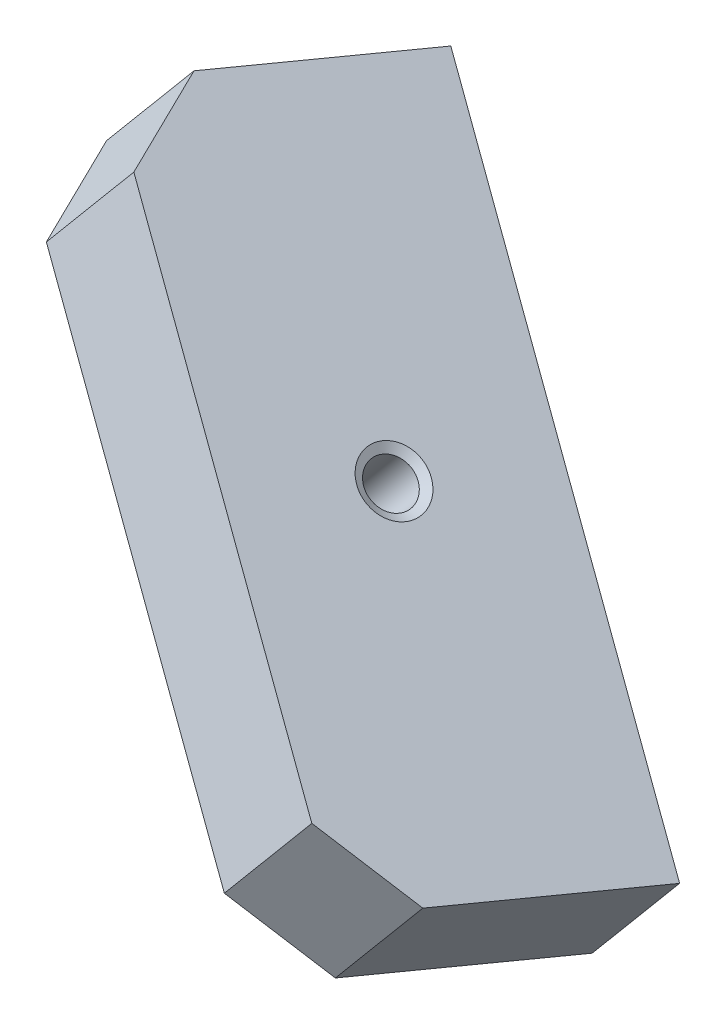
ISO-10303-21;
HEADER;
FILE_DESCRIPTION(('STEP AP214'),'2;1');
FILE_NAME('part.step','',(''),(''),'','','');
FILE_SCHEMA(('AUTOMOTIVE_DESIGN { 1 0 10303 214 1 1 1 1 }'));
ENDSEC;
DATA;
#1=APPLICATION_CONTEXT('core data for automotive mechanical design processes');
#2=APPLICATION_PROTOCOL_DEFINITION('international standard','automotive_design',2000,#1);
#3=PRODUCT_CONTEXT('',#1,'mechanical');
#4=PRODUCT('Part','Part','',(#3));
#5=PRODUCT_RELATED_PRODUCT_CATEGORY('part','',(#4));
#6=PRODUCT_DEFINITION_FORMATION('','',#4);
#7=PRODUCT_DEFINITION_CONTEXT('part definition',#1,'design');
#8=PRODUCT_DEFINITION('design','',#6,#7);
#9=PRODUCT_DEFINITION_SHAPE('','',#8);
#10=(LENGTH_UNIT() NAMED_UNIT(*) SI_UNIT(.MILLI.,.METRE.));
#11=(NAMED_UNIT(*) PLANE_ANGLE_UNIT() SI_UNIT($,.RADIAN.));
#12=(NAMED_UNIT(*) SI_UNIT($,.STERADIAN.) SOLID_ANGLE_UNIT());
#13=UNCERTAINTY_MEASURE_WITH_UNIT(LENGTH_MEASURE(1.E-05),#10,'distance_accuracy_value','');
#14=(GEOMETRIC_REPRESENTATION_CONTEXT(3) GLOBAL_UNCERTAINTY_ASSIGNED_CONTEXT((#13)) GLOBAL_UNIT_ASSIGNED_CONTEXT((#10,
#11,#12)) REPRESENTATION_CONTEXT('',''));
#15=CARTESIAN_POINT('',(0.,0.,0.));
#16=DIRECTION('',(0.,0.,1.));
#17=DIRECTION('',(1.,0.,0.));
#18=AXIS2_PLACEMENT_3D('',#15,#16,#17);
#19=CARTESIAN_POINT('',(-806.92160048545,851.163689518763,-83.4467635691451));
#20=DIRECTION('',(-0.273404616153146,0.229413715678967,0.934140922411882));
#21=DIRECTION('',(-0.715593458704933,0.600454215393007,-0.356904380857785));
#22=AXIS2_PLACEMENT_3D('',#19,#20,#21);
#23=PLANE('',#22);
#24=DIRECTION('',(-0.642787614788012,-0.766044438838334,0.));
#25=VECTOR('',#24,1.);
#26=CARTESIAN_POINT('',(-846.012318211751,892.245414823587,-104.977020344391));
#27=LINE('',#26,#25);
#28=CARTESIAN_POINT('',(-842.093886197581,896.915220190653,-104.977020344391));
#29=VERTEX_POINT('',#28);
#30=CARTESIAN_POINT('',(-849.930750225926,887.575609456514,-104.977020344391));
#31=VERTEX_POINT('',#30);
#32=EDGE_CURVE('E11',#29,#31,#27,.T.);
#33=ORIENTED_EDGE('',*,*,#32,.T.);
#34=DIRECTION('',(0.715593458704933,-0.600454215393007,0.356904380857786));
#35=VECTOR('',#34,1.);
#36=CARTESIAN_POINT('',(-861.290796382867,897.107820125878,-110.642877390508));
#37=LINE('',#36,#35);
#38=CARTESIAN_POINT('',(-818.122620986493,860.885419582295,-89.1126206152625));
#39=VERTEX_POINT('',#38);
#40=EDGE_CURVE('E27',#31,#39,#37,.T.);
#41=ORIENTED_EDGE('',*,*,#40,.T.);
#42=DIRECTION('',(0.642787614788012,0.766044438838334,0.));
#43=VECTOR('',#42,1.);
#44=CARTESIAN_POINT('',(-814.204188972317,865.555224949368,-89.1126206152626));
#45=LINE('',#44,#43);
#46=CARTESIAN_POINT('',(-810.285756958148,870.225030316435,-89.1126206152625));
#47=VERTEX_POINT('',#46);
#48=EDGE_CURVE('E145',#39,#47,#45,.T.);
#49=ORIENTED_EDGE('',*,*,#48,.T.);
#50=DIRECTION('',(0.715593458704933,-0.600454215393007,0.356904380857786));
#51=VECTOR('',#50,1.);
#52=CARTESIAN_POINT('',(-853.453932354522,906.447430860018,-110.642877390508));
#53=LINE('',#52,#51);
#54=EDGE_CURVE('E131',#29,#47,#53,.T.);
#55=ORIENTED_EDGE('',*,*,#54,.F.);
#56=EDGE_LOOP('',(#33,#41,#49,#55));
#57=FACE_BOUND('',#56,.T.);
#58=ADVANCED_FACE('F17',(#57),#23,.T.);
#59=CARTESIAN_POINT('',(-806.793150929325,851.055907542136,-110.573457226078));
#60=DIRECTION('',(0.715593458704941,-0.600454215393014,0.35690438085776));
#61=DIRECTION('',(-0.273404616153127,0.229413715678951,0.934140922411891));
#62=AXIS2_PLACEMENT_3D('',#59,#60,#61);
#63=PLANE('',#62);
#64=DIRECTION('',(0.273404616153127,-0.229413715678951,-0.934140922411891));
#65=VECTOR('',#64,1.);
#66=CARTESIAN_POINT('',(-813.578602523716,857.07253531455,-86.8462777968157));
#67=LINE('',#66,#65);
#68=CARTESIAN_POINT('',(-811.842483211144,855.615758219988,-92.7780726541314));
#69=VERTEX_POINT('',#68);
#70=CARTESIAN_POINT('',(-806.634125273427,851.245426936304,-110.573457226078));
#71=VERTEX_POINT('',#70);
#72=EDGE_CURVE('E147',#69,#71,#67,.T.);
#73=ORIENTED_EDGE('',*,*,#72,.T.);
#74=DIRECTION('',(0.642787614788012,0.766044438838334,0.));
#75=VECTOR('',#74,1.);
#76=CARTESIAN_POINT('',(-806.793150929325,851.055907542136,-110.573457226078));
#77=LINE('',#76,#75);
#78=CARTESIAN_POINT('',(-798.797261245082,860.585037670444,-110.573457226078));
#79=VERTEX_POINT('',#78);
#80=EDGE_CURVE('E150',#71,#79,#77,.T.);
#81=ORIENTED_EDGE('',*,*,#80,.T.);
#82=DIRECTION('',(0.273404616153127,-0.229413715678951,-0.934140922411891));
#83=VECTOR('',#82,1.);
#84=CARTESIAN_POINT('',(-805.741738495371,866.412146048689,-86.8462777968155));
#85=LINE('',#84,#83);
#86=CARTESIAN_POINT('',(-804.005619182799,864.955368954128,-92.7780726541314));
#87=VERTEX_POINT('',#86);
#88=EDGE_CURVE('E154',#87,#79,#85,.T.);
#89=ORIENTED_EDGE('',*,*,#88,.F.);
#90=DIRECTION('',(0.642787614788012,0.766044438838334,0.));
#91=VECTOR('',#90,1.);
#92=CARTESIAN_POINT('',(-807.924051196968,860.285563587061,-92.7780726541314));
#93=LINE('',#92,#91);
#94=EDGE_CURVE('E156',#69,#87,#93,.T.);
#95=ORIENTED_EDGE('',*,*,#94,.F.);
#96=EDGE_LOOP('',(#73,#81,#89,#95));
#97=FACE_BOUND('',#96,.T.);
#98=ADVANCED_FACE('F226',(#97),#63,.T.);
#99=CARTESIAN_POINT('',(-854.505344788476,891.091192353465,-134.37005681977));
#100=DIRECTION('',(0.273404616153145,-0.229413715678966,-0.934140922411882));
#101=DIRECTION('',(0.715593458704934,-0.600454215393008,0.356904380857784));
#102=AXIS2_PLACEMENT_3D('',#99,#100,#101);
#103=PLANE('',#102);
#104=CARTESIAN_POINT('',(-814.075740702054,865.447441440306,-116.239314272193));
#105=DIRECTION('',(0.273404616153145,-0.229413715678969,-0.934140922411881));
#106=DIRECTION('',(0.715593458704933,-0.600454215393007,0.356904380857786));
#107=AXIS2_PLACEMENT_3D('',#104,#105,#106);
#108=CIRCLE('',#107,2.76860000000004);
#109=CARTESIAN_POINT('',(-812.094548652283,863.785023899569,-115.25118880335));
#110=VERTEX_POINT('',#109);
#111=EDGE_CURVE('E161',#110,#110,#108,.T.);
#112=ORIENTED_EDGE('',*,*,#111,.F.);
#113=EDGE_LOOP('',(#112));
#114=FACE_BOUND('',#113,.T.);
#115=CARTESIAN_POINT('',(-807.25971300789,859.728115038685,-112.839800044523));
#116=DIRECTION('',(0.273404616153145,-0.229413715678967,-0.934140922411882));
#117=DIRECTION('',(-0.715593458704933,0.600454215393008,-0.356904380857784));
#118=AXIS2_PLACEMENT_3D('',#115,#116,#117);
#119=CIRCLE('',#118,2.40665);
#120=CARTESIAN_POINT('',(-808.981896005282,861.173198176161,-113.698743972714));
#121=VERTEX_POINT('',#120);
#122=EDGE_CURVE('E165',#121,#121,#119,.T.);
#123=ORIENTED_EDGE('',*,*,#122,.F.);
#124=EDGE_LOOP('',(#123));
#125=FACE_BOUND('',#124,.T.);
#126=DIRECTION('',(-0.715593458704934,0.600454215393008,-0.356904380857784));
#127=VECTOR('',#126,1.);
#128=CARTESIAN_POINT('',(-1148.60729655828,1143.01109190239,-282.316376402553));
#129=LINE('',#128,#127);
#130=CARTESIAN_POINT('',(-839.524242629388,883.659611839916,-128.160277497224));
#131=VERTEX_POINT('',#130);
#132=CARTESIAN_POINT('',(-841.705371491521,885.489796288434,-129.248122050079));
#133=VERTEX_POINT('',#132);
#134=EDGE_CURVE('E118',#131,#133,#129,.T.);
#135=ORIENTED_EDGE('',*,*,#134,.F.);
#136=CARTESIAN_POINT('',(-837.977277816258,885.503212688646,-128.160277497224));
#137=DIRECTION('',(0.273404616153145,-0.229413715678966,-0.934140922411882));
#138=DIRECTION('',(-0.715593458704934,0.600454215393008,-0.356904380857784));
#139=AXIS2_PLACEMENT_3D('',#136,#137,#138);
#140=CIRCLE('',#139,2.40665);
#141=CARTESIAN_POINT('',(-836.430313003129,887.346813537376,-128.160277497224));
#142=VERTEX_POINT('',#141);
#143=EDGE_CURVE('E171',#142,#131,#140,.T.);
#144=ORIENTED_EDGE('',*,*,#143,.F.);
#145=DIRECTION('',(0.715593458704934,-0.600454215393008,0.356904380857784));
#146=VECTOR('',#145,1.);
#147=CARTESIAN_POINT('',(-1145.51336693202,1146.69829359985,-282.316376402553));
#148=LINE('',#147,#146);
#149=CARTESIAN_POINT('',(-838.611441865262,889.176997985894,-129.248122050079));
#150=VERTEX_POINT('',#149);
#151=EDGE_CURVE('E176',#150,#142,#148,.T.);
#152=ORIENTED_EDGE('',*,*,#151,.F.);
#153=CARTESIAN_POINT('',(-840.158406678391,887.333397137164,-129.248122050079));
#154=DIRECTION('',(0.273404616153145,-0.229413715678966,-0.934140922411882));
#155=DIRECTION('',(-0.715593458704934,0.600454215393008,-0.356904380857784));
#156=AXIS2_PLACEMENT_3D('',#153,#154,#155);
#157=CIRCLE('',#156,2.40665);
#158=EDGE_CURVE('E122',#133,#150,#157,.T.);
#159=ORIENTED_EDGE('',*,*,#158,.F.);
#160=EDGE_LOOP('',(#135,#144,#152,#159));
#161=FACE_BOUND('',#160,.T.);
#162=CARTESIAN_POINT('',(-832.25181455316,880.698978511286,-125.304685545981));
#163=DIRECTION('',(0.273404616153142,-0.229413715679067,-0.934140922411858));
#164=DIRECTION('',(0.715593458704915,-0.600454215392992,0.356904380857847));
#165=AXIS2_PLACEMENT_3D('',#162,#163,#164);
#166=CIRCLE('',#165,2.76859999999968);
#167=CARTESIAN_POINT('',(-830.27062250339,879.036560970549,-124.316560077138));
#168=VERTEX_POINT('',#167);
#169=EDGE_CURVE('E179',#168,#168,#166,.T.);
#170=ORIENTED_EDGE('',*,*,#169,.F.);
#171=EDGE_LOOP('',(#170));
#172=FACE_BOUND('',#171,.T.);
#173=DIRECTION('',(-0.715593458704934,0.600454215393008,-0.356904380857784));
#174=VECTOR('',#173,1.);
#175=CARTESIAN_POINT('',(-799.818097579262,845.526100534685,-107.173942998407));
#176=LINE('',#175,#174);
#177=CARTESIAN_POINT('',(-847.530291438414,885.561385346014,-130.9705425921));
#178=VERTEX_POINT('',#177);
#179=EDGE_CURVE('E153',#71,#178,#176,.T.);
#180=ORIENTED_EDGE('',*,*,#179,.T.);
#181=DIRECTION('',(0.642787614788012,0.766044438838334,0.));
#182=VECTOR('',#181,1.);
#183=CARTESIAN_POINT('',(-847.689317094312,885.371865951846,-130.9705425921));
#184=LINE('',#183,#182);
#185=CARTESIAN_POINT('',(-839.693427410068,894.900996080154,-130.9705425921));
#186=VERTEX_POINT('',#185);
#187=EDGE_CURVE('E186',#178,#186,#184,.T.);
#188=ORIENTED_EDGE('',*,*,#187,.T.);
#189=DIRECTION('',(-0.715593458704934,0.600454215393008,-0.356904380857784));
#190=VECTOR('',#189,1.);
#191=CARTESIAN_POINT('',(-791.981233550917,854.865711268825,-107.173942998407));
#192=LINE('',#191,#190);
#193=EDGE_CURVE('E141',#79,#186,#192,.T.);
#194=ORIENTED_EDGE('',*,*,#193,.F.);
#195=ORIENTED_EDGE('',*,*,#80,.F.);
#196=EDGE_LOOP('',(#180,#188,#194,#195));
#197=FACE_BOUND('',#196,.T.);
#198=ADVANCED_FACE('F222',(#114,#125,#161,#172,#197),#103,.T.);
#199=CARTESIAN_POINT('',(-854.633794344601,891.198974330091,-107.243363162838));
#200=DIRECTION('',(-0.715593458704943,0.600454215393015,-0.356904380857753));
#201=DIRECTION('',(0.273404616153121,-0.229413715678946,-0.934140922411894));
#202=AXIS2_PLACEMENT_3D('',#199,#200,#201);
#203=PLANE('',#202);
#204=DIRECTION('',(-0.273404616153121,0.229413715678946,0.934140922411894));
#205=VECTOR('',#204,1.);
#206=CARTESIAN_POINT('',(-847.530291438413,885.561385346014,-130.9705425921));
#207=LINE('',#206,#205);
#208=CARTESIAN_POINT('',(-852.73864937613,889.931716629698,-113.175158020153));
#209=VERTEX_POINT('',#208);
#210=EDGE_CURVE('E182',#178,#209,#207,.T.);
#211=ORIENTED_EDGE('',*,*,#210,.T.);
#212=DIRECTION('',(-0.642787614788012,-0.766044438838334,0.));
#213=VECTOR('',#212,1.);
#214=CARTESIAN_POINT('',(-848.820217361955,894.601521996771,-113.175158020153));
#215=LINE('',#214,#213);
#216=CARTESIAN_POINT('',(-844.901785347785,899.271327363838,-113.175158020153));
#217=VERTEX_POINT('',#216);
#218=EDGE_CURVE('E168',#217,#209,#215,.T.);
#219=ORIENTED_EDGE('',*,*,#218,.F.);
#220=DIRECTION('',(-0.273404616153121,0.229413715678946,0.934140922411894));
#221=VECTOR('',#220,1.);
#222=CARTESIAN_POINT('',(-839.693427410069,894.900996080154,-130.9705425921));
#223=LINE('',#222,#221);
#224=EDGE_CURVE('E134',#186,#217,#223,.T.);
#225=ORIENTED_EDGE('',*,*,#224,.F.);
#226=ORIENTED_EDGE('',*,*,#187,.F.);
#227=EDGE_LOOP('',(#211,#219,#225,#226));
#228=FACE_BOUND('',#227,.T.);
#229=ADVANCED_FACE('F225',(#228),#203,.T.);
#230=CARTESIAN_POINT('',(-832.25181455316,880.698978511286,-125.304685545981));
#231=DIRECTION('',(0.273404616153142,-0.229413715679067,-0.934140922411858));
#232=DIRECTION('',(0.715593452068121,-0.600454223302416,0.356904380857846));
#233=AXIS2_PLACEMENT_3D('',#230,#231,#232);
#234=CYLINDRICAL_SURFACE('',#233,2.0193);
#235=CARTESIAN_POINT('',(-832.37009172955,880.798224847714,-124.900568189778));
#236=DIRECTION('',(0.273404616153142,-0.229413715679067,-0.934140922411858));
#237=DIRECTION('',(0.715593458704915,-0.600454215392992,0.356904380857847));
#238=AXIS2_PLACEMENT_3D('',#235,#236,#237);
#239=CIRCLE('',#238,2.0193);
#240=CARTESIAN_POINT('',(-830.925093858387,879.585727650571,-124.179871173512));
#241=VERTEX_POINT('',#240);
#242=EDGE_CURVE('E183',#241,#241,#239,.T.);
#243=ORIENTED_EDGE('',*,*,#242,.T.);
#244=EDGE_LOOP('',(#243));
#245=FACE_BOUND('',#244,.T.);
#246=CARTESIAN_POINT('',(-835.175439475532,883.152191138529,-115.315543006262));
#247=DIRECTION('',(0.273404616153142,-0.229413715679067,-0.934140922411858));
#248=DIRECTION('',(0.715593452068121,-0.600454223302416,0.356904380857847));
#249=AXIS2_PLACEMENT_3D('',#246,#247,#248);
#250=CIRCLE('',#249,2.0193);
#251=CARTESIAN_POINT('',(-833.730441617771,881.939693925415,-114.594845989996));
#252=VERTEX_POINT('',#251);
#253=EDGE_CURVE('E159',#252,#252,#250,.T.);
#254=ORIENTED_EDGE('',*,*,#253,.F.);
#255=EDGE_LOOP('',(#254));
#256=FACE_BOUND('',#255,.T.);
#257=ADVANCED_FACE('F272',(#245,#256),#234,.F.);
#258=CARTESIAN_POINT('',(-832.37009172955,880.798224847714,-124.900568189778));
#259=DIRECTION('',(0.273404616153193,-0.229413715679057,-0.934140922411846));
#260=DIRECTION('',(0.715593458704906,-0.600454215392984,0.356904380857879));
#261=AXIS2_PLACEMENT_3D('',#258,#259,#260);
#262=CONICAL_SURFACE('',#261,2.0193,1.04719755119659);
#263=ORIENTED_EDGE('',*,*,#169,.T.);
#264=EDGE_LOOP('',(#263));
#265=FACE_BOUND('',#264,.T.);
#266=ORIENTED_EDGE('',*,*,#242,.F.);
#267=EDGE_LOOP('',(#266));
#268=FACE_BOUND('',#267,.T.);
#269=ADVANCED_FACE('F275',(#265,#268),#262,.F.);
#270=CARTESIAN_POINT('',(-835.175439475532,883.152191138529,-115.315543006262));
#271=DIRECTION('',(0.273404616153087,-0.22941371567896,-0.934140922411901));
#272=DIRECTION('',(0.715593452068153,-0.600454223302443,0.356904380857735));
#273=AXIS2_PLACEMENT_3D('',#270,#271,#272);
#274=CONICAL_SURFACE('',#273,2.0193,1.02974425867667);
#275=ORIENTED_EDGE('',*,*,#253,.T.);
#276=EDGE_LOOP('',(#275));
#277=FACE_BOUND('',#276,.T.);
#278=CARTESIAN_POINT('',(-835.507166176037,883.430542894339,-114.182133152551));
#279=VERTEX_POINT('',#278);
#280=VERTEX_LOOP('',#279);
#281=FACE_BOUND('',#280,.T.);
#282=ADVANCED_FACE('F279',(#277,#281),#274,.F.);
#283=CARTESIAN_POINT('',(-811.064120084643,862.920394268215,-90.945346634697));
#284=DIRECTION('',(0.312674729133423,-0.262365253442663,0.91290688876101));
#285=DIRECTION('',(0.699327245312578,-0.586805241550235,-0.408167872881603));
#286=AXIS2_PLACEMENT_3D('',#283,#284,#285);
#287=PLANE('',#286);
#288=ORIENTED_EDGE('',*,*,#48,.F.);
#289=DIRECTION('',(-0.699327245312578,0.586805241550235,0.408167872881603));
#290=VECTOR('',#289,1.);
#291=CARTESIAN_POINT('',(-1176.03259272723,1161.20754892631,119.784362632163));
#292=LINE('',#291,#290);
#293=EDGE_CURVE('E198',#69,#39,#292,.T.);
#294=ORIENTED_EDGE('',*,*,#293,.F.);
#295=ORIENTED_EDGE('',*,*,#94,.T.);
#296=DIRECTION('',(-0.699327245312578,0.586805241550235,0.408167872881603));
#297=VECTOR('',#296,1.);
#298=CARTESIAN_POINT('',(-1168.19572869888,1170.54715966045,119.784362632163));
#299=LINE('',#298,#297);
#300=EDGE_CURVE('E160',#87,#47,#299,.T.);
#301=ORIENTED_EDGE('',*,*,#300,.T.);
#302=EDGE_LOOP('',(#288,#294,#295,#301));
#303=FACE_BOUND('',#302,.T.);
#304=ADVANCED_FACE('F243',(#303),#287,.T.);
#305=CARTESIAN_POINT('',(-814.194017878444,865.546687776733,-115.835196915991));
#306=DIRECTION('',(0.273404616153093,-0.229413715679055,-0.934140922411875));
#307=DIRECTION('',(0.715593458704929,-0.600454215393003,0.356904380857801));
#308=AXIS2_PLACEMENT_3D('',#305,#306,#307);
#309=CONICAL_SURFACE('',#308,2.01930000000002,1.04719755119659);
#310=ORIENTED_EDGE('',*,*,#111,.T.);
#311=EDGE_LOOP('',(#310));
#312=FACE_BOUND('',#311,.T.);
#313=CARTESIAN_POINT('',(-814.194017878444,865.546687776733,-115.835196915991));
#314=DIRECTION('',(0.273404616153145,-0.229413715678969,-0.934140922411881));
#315=DIRECTION('',(0.715593458704933,-0.600454215393007,0.356904380857786));
#316=AXIS2_PLACEMENT_3D('',#313,#314,#315);
#317=CIRCLE('',#316,2.01930000000002);
#318=CARTESIAN_POINT('',(-812.749020007281,864.33419057959,-115.114499899725));
#319=VERTEX_POINT('',#318);
#320=EDGE_CURVE('E164',#319,#319,#317,.T.);
#321=ORIENTED_EDGE('',*,*,#320,.F.);
#322=EDGE_LOOP('',(#321));
#323=FACE_BOUND('',#322,.T.);
#324=ADVANCED_FACE('F286',(#312,#323),#309,.F.);
#325=CARTESIAN_POINT('',(-814.075740702054,865.447441440306,-116.239314272193));
#326=DIRECTION('',(0.273404616153145,-0.229413715678969,-0.934140922411881));
#327=DIRECTION('',(0.715593460414943,-0.600454213355096,0.356904380857786));
#328=AXIS2_PLACEMENT_3D('',#325,#326,#327);
#329=CYLINDRICAL_SURFACE('',#328,2.0193);
#330=ORIENTED_EDGE('',*,*,#320,.T.);
#331=EDGE_LOOP('',(#330));
#332=FACE_BOUND('',#331,.T.);
#333=CARTESIAN_POINT('',(-816.999365624426,867.900654067547,-106.250171732474));
#334=DIRECTION('',(0.273404616153145,-0.229413715678969,-0.934140922411881));
#335=DIRECTION('',(0.715593460414943,-0.600454213355096,0.356904380857786));
#336=AXIS2_PLACEMENT_3D('',#333,#334,#335);
#337=CIRCLE('',#336,2.0193);
#338=CARTESIAN_POINT('',(-815.55436774981,866.688156874519,-105.529474716208));
#339=VERTEX_POINT('',#338);
#340=EDGE_CURVE('E205',#339,#339,#337,.T.);
#341=ORIENTED_EDGE('',*,*,#340,.F.);
#342=EDGE_LOOP('',(#341));
#343=FACE_BOUND('',#342,.T.);
#344=ADVANCED_FACE('F260',(#332,#343),#329,.F.);
#345=CARTESIAN_POINT('',(-816.999365624426,867.900654067547,-106.250171732474));
#346=DIRECTION('',(0.273404616153081,-0.229413715678955,-0.934140922411904));
#347=DIRECTION('',(0.71559346041496,-0.600454213355111,0.356904380857728));
#348=AXIS2_PLACEMENT_3D('',#345,#346,#347);
#349=CONICAL_SURFACE('',#348,2.0193,1.02974425867666);
#350=ORIENTED_EDGE('',*,*,#340,.T.);
#351=EDGE_LOOP('',(#350));
#352=FACE_BOUND('',#351,.T.);
#353=CARTESIAN_POINT('',(-817.33109232493,868.179005823357,-105.116761878762));
#354=VERTEX_POINT('',#353);
#355=VERTEX_LOOP('',#354);
#356=FACE_BOUND('',#355,.T.);
#357=ADVANCED_FACE('F250',(#352,#356),#349,.F.);
#358=CARTESIAN_POINT('',(-847.416267786853,893.423468410179,-109.076089182272));
#359=DIRECTION('',(-0.699327245312578,0.586805241550235,0.408167872881602));
#360=DIRECTION('',(-0.312674729133423,0.262365253442662,-0.912906888761011));
#361=AXIS2_PLACEMENT_3D('',#358,#359,#360);
#362=PLANE('',#361);
#363=ORIENTED_EDGE('',*,*,#32,.F.);
#364=DIRECTION('',(-0.312674729133422,0.262365253442662,-0.912906888761011));
#365=VECTOR('',#364,1.);
#366=CARTESIAN_POINT('',(-847.211508842308,901.209415522425,-119.918787398603));
#367=LINE('',#366,#365);
#368=EDGE_CURVE('E192',#29,#217,#367,.T.);
#369=ORIENTED_EDGE('',*,*,#368,.T.);
#370=ORIENTED_EDGE('',*,*,#218,.T.);
#371=DIRECTION('',(-0.312674729133422,0.262365253442662,-0.912906888761011));
#372=VECTOR('',#371,1.);
#373=CARTESIAN_POINT('',(-855.048372870653,891.869804788285,-119.918787398603));
#374=LINE('',#373,#372);
#375=EDGE_CURVE('E200',#31,#209,#374,.T.);
#376=ORIENTED_EDGE('',*,*,#375,.F.);
#377=EDGE_LOOP('',(#363,#369,#370,#376));
#378=FACE_BOUND('',#377,.T.);
#379=ADVANCED_FACE('F247',(#378),#362,.T.);
#380=CARTESIAN_POINT('',(-807.259713007891,859.728115038685,-112.839800044523));
#381=DIRECTION('',(0.273404616153145,-0.229413715678967,-0.934140922411882));
#382=DIRECTION('',(-0.715593458704933,0.600454215393008,-0.356904380857784));
#383=AXIS2_PLACEMENT_3D('',#380,#381,#382);
#384=CYLINDRICAL_SURFACE('',#383,2.40665);
#385=ORIENTED_EDGE('',*,*,#122,.T.);
#386=EDGE_LOOP('',(#385));
#387=FACE_BOUND('',#386,.T.);
#388=CARTESIAN_POINT('',(-809.429862148606,861.549086406887,-105.425056472878));
#389=DIRECTION('',(0.273404616153145,-0.229413715678967,-0.934140922411882));
#390=DIRECTION('',(-0.715593458704933,0.600454215393008,-0.356904380857784));
#391=AXIS2_PLACEMENT_3D('',#388,#389,#390);
#392=CIRCLE('',#391,2.40665);
#393=CARTESIAN_POINT('',(-811.152045145998,862.994169544363,-106.284000401069));
#394=VERTEX_POINT('',#393);
#395=EDGE_CURVE('E169',#394,#394,#392,.T.);
#396=ORIENTED_EDGE('',*,*,#395,.F.);
#397=EDGE_LOOP('',(#396));
#398=FACE_BOUND('',#397,.T.);
#399=ADVANCED_FACE('F249',(#387,#398),#384,.F.);
#400=CARTESIAN_POINT('',(-825.33392548246,874.894182876435,-113.357256337444));
#401=DIRECTION('',(0.273404616153145,-0.229413715678966,-0.934140922411882));
#402=DIRECTION('',(-0.715593458704934,0.600454215393008,-0.356904380857784));
#403=AXIS2_PLACEMENT_3D('',#400,#401,#402);
#404=PLANE('',#403);
#405=ORIENTED_EDGE('',*,*,#395,.T.);
#406=EDGE_LOOP('',(#405));
#407=FACE_BOUND('',#406,.T.);
#408=ADVANCED_FACE('F257',(#407),#404,.T.);
#409=CARTESIAN_POINT('',(-837.977277816259,885.503212688646,-128.160277497223));
#410=DIRECTION('',(0.273404616153145,-0.229413715678966,-0.934140922411882));
#411=DIRECTION('',(-0.715593458704934,0.600454215393008,-0.356904380857784));
#412=AXIS2_PLACEMENT_3D('',#409,#410,#411);
#413=CYLINDRICAL_SURFACE('',#412,2.40665);
#414=DIRECTION('',(-0.273404616153145,0.229413715678966,0.934140922411882));
#415=VECTOR('',#414,1.);
#416=CARTESIAN_POINT('',(-839.524242629388,883.659611839916,-128.160277497223));
#417=LINE('',#416,#415);
#418=CARTESIAN_POINT('',(-841.694391770104,885.480583208118,-120.745533925579));
#419=VERTEX_POINT('',#418);
#420=EDGE_CURVE('E174',#131,#419,#417,.T.);
#421=ORIENTED_EDGE('',*,*,#420,.T.);
#422=CARTESIAN_POINT('',(-840.147426956975,887.324184056848,-120.745533925579));
#423=DIRECTION('',(0.273404616153145,-0.229413715678966,-0.934140922411882));
#424=DIRECTION('',(-0.715593458704934,0.600454215393008,-0.356904380857784));
#425=AXIS2_PLACEMENT_3D('',#422,#423,#424);
#426=CIRCLE('',#425,2.40665);
#427=CARTESIAN_POINT('',(-838.600462143845,889.167784905578,-120.745533925579));
#428=VERTEX_POINT('',#427);
#429=EDGE_CURVE('E110',#428,#419,#426,.T.);
#430=ORIENTED_EDGE('',*,*,#429,.F.);
#431=DIRECTION('',(-0.273404616153145,0.229413715678966,0.934140922411882));
#432=VECTOR('',#431,1.);
#433=CARTESIAN_POINT('',(-836.430313003129,887.346813537376,-128.160277497223));
#434=LINE('',#433,#432);
#435=EDGE_CURVE('E175',#142,#428,#434,.T.);
#436=ORIENTED_EDGE('',*,*,#435,.F.);
#437=ORIENTED_EDGE('',*,*,#143,.T.);
#438=EDGE_LOOP('',(#421,#430,#436,#437));
#439=FACE_BOUND('',#438,.T.);
#440=ADVANCED_FACE('F220',(#439),#413,.F.);
#441=CARTESIAN_POINT('',(-838.611441865262,889.176997985894,-129.248122050078));
#442=DIRECTION('',(0.642787614788012,0.766044438838334,0.));
#443=DIRECTION('',(-0.273404616153145,0.229413715678966,0.934140922411882));
#444=AXIS2_PLACEMENT_3D('',#441,#442,#443);
#445=PLANE('',#444);
#446=ORIENTED_EDGE('',*,*,#435,.T.);
#447=DIRECTION('',(0.715593458704934,-0.600454215393008,0.356904380857784));
#448=VECTOR('',#447,1.);
#449=CARTESIAN_POINT('',(-840.781591005978,890.997969354096,-121.833378478433));
#450=LINE('',#449,#448);
#451=CARTESIAN_POINT('',(-840.781591005978,890.997969354096,-121.833378478433));
#452=VERTEX_POINT('',#451);
#453=EDGE_CURVE('E97',#452,#428,#450,.T.);
#454=ORIENTED_EDGE('',*,*,#453,.F.);
#455=DIRECTION('',(-0.273404616153145,0.229413715678966,0.934140922411882));
#456=VECTOR('',#455,1.);
#457=CARTESIAN_POINT('',(-838.611441865262,889.176997985894,-129.248122050078));
#458=LINE('',#457,#456);
#459=EDGE_CURVE('E108',#150,#452,#458,.T.);
#460=ORIENTED_EDGE('',*,*,#459,.F.);
#461=ORIENTED_EDGE('',*,*,#151,.T.);
#462=EDGE_LOOP('',(#446,#454,#460,#461));
#463=FACE_BOUND('',#462,.T.);
#464=ADVANCED_FACE('F217',(#463),#445,.F.);
#465=CARTESIAN_POINT('',(-840.158406678391,887.333397137164,-129.248122050078));
#466=DIRECTION('',(0.273404616153145,-0.229413715678966,-0.934140922411882));
#467=DIRECTION('',(-0.715593458704934,0.600454215393008,-0.356904380857784));
#468=AXIS2_PLACEMENT_3D('',#465,#466,#467);
#469=CYLINDRICAL_SURFACE('',#468,2.40665);
#470=ORIENTED_EDGE('',*,*,#459,.T.);
#471=CARTESIAN_POINT('',(-842.328555819107,889.154368505366,-121.833378478433));
#472=DIRECTION('',(0.273404616153145,-0.229413715678966,-0.934140922411882));
#473=DIRECTION('',(-0.715593458704934,0.600454215393008,-0.356904380857784));
#474=AXIS2_PLACEMENT_3D('',#471,#472,#473);
#475=CIRCLE('',#474,2.40665);
#476=CARTESIAN_POINT('',(-843.875520632237,887.310767656636,-121.833378478433));
#477=VERTEX_POINT('',#476);
#478=EDGE_CURVE('E103',#477,#452,#475,.T.);
#479=ORIENTED_EDGE('',*,*,#478,.F.);
#480=DIRECTION('',(-0.273404616153145,0.229413715678966,0.934140922411882));
#481=VECTOR('',#480,1.);
#482=CARTESIAN_POINT('',(-841.705371491521,885.489796288434,-129.248122050078));
#483=LINE('',#482,#481);
#484=EDGE_CURVE('E107',#133,#477,#483,.T.);
#485=ORIENTED_EDGE('',*,*,#484,.F.);
#486=ORIENTED_EDGE('',*,*,#158,.T.);
#487=EDGE_LOOP('',(#470,#479,#485,#486));
#488=FACE_BOUND('',#487,.T.);
#489=ADVANCED_FACE('F105',(#488),#469,.F.);
#490=CARTESIAN_POINT('',(-839.524242629388,883.659611839916,-128.160277497223));
#491=DIRECTION('',(-0.642787614788012,-0.766044438838334,0.));
#492=DIRECTION('',(0.273404616153145,-0.229413715678966,-0.934140922411882));
#493=AXIS2_PLACEMENT_3D('',#490,#491,#492);
#494=PLANE('',#493);
#495=ORIENTED_EDGE('',*,*,#484,.T.);
#496=DIRECTION('',(0.715593458704934,-0.600454215393008,0.356904380857784));
#497=VECTOR('',#496,1.);
#498=CARTESIAN_POINT('',(-843.875520632237,887.310767656636,-121.833378478433));
#499=LINE('',#498,#497);
#500=EDGE_CURVE('E113',#477,#419,#499,.T.);
#501=ORIENTED_EDGE('',*,*,#500,.T.);
#502=ORIENTED_EDGE('',*,*,#420,.F.);
#503=ORIENTED_EDGE('',*,*,#134,.T.);
#504=EDGE_LOOP('',(#495,#501,#502,#503));
#505=FACE_BOUND('',#504,.T.);
#506=ADVANCED_FACE('F121',(#505),#494,.F.);
#507=CARTESIAN_POINT('',(-825.333925482461,874.894182876435,-113.357256337443));
#508=DIRECTION('',(0.273404616153145,-0.229413715678967,-0.934140922411882));
#509=DIRECTION('',(-0.715593458704933,0.600454215393008,-0.356904380857785));
#510=AXIS2_PLACEMENT_3D('',#507,#508,#509);
#511=PLANE('',#510);
#512=ORIENTED_EDGE('',*,*,#429,.T.);
#513=ORIENTED_EDGE('',*,*,#500,.F.);
#514=ORIENTED_EDGE('',*,*,#478,.T.);
#515=ORIENTED_EDGE('',*,*,#453,.T.);
#516=EDGE_LOOP('',(#512,#513,#514,#515));
#517=FACE_BOUND('',#516,.T.);
#518=ADVANCED_FACE('F114',(#517),#511,.T.);
#519=CARTESIAN_POINT('',(-1151.24906425348,1156.32721958232,-152.200648387988));
#520=DIRECTION('',(0.642787614788012,0.766044438838334,0.));
#521=DIRECTION('',(-0.763523012879617,0.640671887167398,-0.0810687473481458));
#522=AXIS2_PLACEMENT_3D('',#519,#520,#521);
#523=PLANE('',#522);
#524=CARTESIAN_POINT('',(-822.71758295272,880.656571064422,-108.908410194458));
#525=DIRECTION('',(0.642787614788012,0.766044438838334,0.));
#526=DIRECTION('',(-0.0621022630696378,0.0521099867417656,0.996708512155586));
#527=AXIS2_PLACEMENT_3D('',#524,#525,#526);
#528=CIRCLE('',#527,2.7686);
#529=CARTESIAN_POINT('',(-822.889519278255,880.800842773715,-106.148923007704));
#530=VERTEX_POINT('',#529);
#531=EDGE_CURVE('E127',#530,#530,#528,.T.);
#532=ORIENTED_EDGE('',*,*,#531,.F.);
#533=EDGE_LOOP('',(#532));
#534=FACE_BOUND('',#533,.T.);
#535=ORIENTED_EDGE('',*,*,#88,.T.);
#536=ORIENTED_EDGE('',*,*,#193,.T.);
#537=ORIENTED_EDGE('',*,*,#224,.T.);
#538=ORIENTED_EDGE('',*,*,#368,.F.);
#539=ORIENTED_EDGE('',*,*,#54,.T.);
#540=ORIENTED_EDGE('',*,*,#300,.F.);
#541=EDGE_LOOP('',(#535,#536,#537,#538,#539,#540));
#542=FACE_BOUND('',#541,.T.);
#543=ADVANCED_FACE('F239',(#534,#542),#523,.T.);
#544=CARTESIAN_POINT('',(-822.684929341889,880.695486121914,-108.908410194458));
#545=DIRECTION('',(0.642787614788012,0.766044438838334,0.));
#546=DIRECTION('',(-0.0621022630696378,0.0521099867417656,0.996708512155586));
#547=AXIS2_PLACEMENT_3D('',#544,#545,#546);
#548=CYLINDRICAL_SURFACE('',#547,2.0193);
#549=CARTESIAN_POINT('',(-822.99565837502,880.325173685365,-108.908410194458));
#550=DIRECTION('',(0.642787614788012,0.766044438838334,0.));
#551=DIRECTION('',(-0.0621022630696378,0.0521099867417656,0.996708512155586));
#552=AXIS2_PLACEMENT_3D('',#549,#550,#551);
#553=CIRCLE('',#552,2.0193);
#554=CARTESIAN_POINT('',(-823.121061474837,880.430399381593,-106.895756695862));
#555=VERTEX_POINT('',#554);
#556=EDGE_CURVE('E129',#555,#555,#553,.T.);
#557=ORIENTED_EDGE('',*,*,#556,.T.);
#558=EDGE_LOOP('',(#557));
#559=FACE_BOUND('',#558,.T.);
#560=CARTESIAN_POINT('',(-830.554446981065,871.316960330282,-108.908410194458));
#561=DIRECTION('',(0.642787614788012,0.766044438838334,0.));
#562=DIRECTION('',(-0.0621022630696378,0.0521099867417656,0.996708512155586));
#563=AXIS2_PLACEMENT_3D('',#560,#561,#562);
#564=CIRCLE('',#563,2.0193);
#565=CARTESIAN_POINT('',(-830.679850080881,871.42218602651,-106.895756695862));
#566=VERTEX_POINT('',#565);
#567=EDGE_CURVE('E21',#566,#566,#564,.T.);
#568=ORIENTED_EDGE('',*,*,#567,.F.);
#569=EDGE_LOOP('',(#568));
#570=FACE_BOUND('',#569,.T.);
#571=ADVANCED_FACE('F364',(#559,#570),#548,.F.);
#572=CARTESIAN_POINT('',(-822.99565837502,880.325173685365,-108.908410194458));
#573=DIRECTION('',(0.642787614788084,0.766044438838274,0.));
#574=DIRECTION('',(-0.763523012879557,0.640671887167469,-0.0810687473481458));
#575=AXIS2_PLACEMENT_3D('',#572,#573,#574);
#576=CONICAL_SURFACE('',#575,2.0193,1.04719755119662);
#577=ORIENTED_EDGE('',*,*,#531,.T.);
#578=EDGE_LOOP('',(#577));
#579=FACE_BOUND('',#578,.T.);
#580=ORIENTED_EDGE('',*,*,#556,.F.);
#581=EDGE_LOOP('',(#580));
#582=FACE_BOUND('',#581,.T.);
#583=ADVANCED_FACE('F372',(#579,#582),#576,.F.);
#584=CARTESIAN_POINT('',(-1159.08592828183,1146.98760884818,-152.200648387988));
#585=DIRECTION('',(0.642787614788012,0.766044438838334,0.));
#586=DIRECTION('',(-0.763523012879617,0.640671887167398,-0.0810687473481458));
#587=AXIS2_PLACEMENT_3D('',#584,#585,#586);
#588=PLANE('',#587);
#589=ORIENTED_EDGE('',*,*,#567,.T.);
#590=EDGE_LOOP('',(#589));
#591=FACE_BOUND('',#590,.T.);
#592=ORIENTED_EDGE('',*,*,#40,.F.);
#593=ORIENTED_EDGE('',*,*,#375,.T.);
#594=ORIENTED_EDGE('',*,*,#210,.F.);
#595=ORIENTED_EDGE('',*,*,#179,.F.);
#596=ORIENTED_EDGE('',*,*,#72,.F.);
#597=ORIENTED_EDGE('',*,*,#293,.T.);
#598=EDGE_LOOP('',(#592,#593,#594,#595,#596,#597));
#599=FACE_BOUND('',#598,.T.);
#600=ADVANCED_FACE('F19',(#591,#599),#588,.F.);
#601=CLOSED_SHELL('',(#58,#98,#198,#229,#257,#269,#282,#304,#324,#344,#357,#379,#399,#408,#440,
#464,#489,#506,#518,#543,#571,#583,#600));
#602=MANIFOLD_SOLID_BREP('B1',#601);
#603=ADVANCED_BREP_SHAPE_REPRESENTATION('',(#18,#602),#14);
#604=SHAPE_DEFINITION_REPRESENTATION(#9,#603);
ENDSEC;
END-ISO-10303-21;
